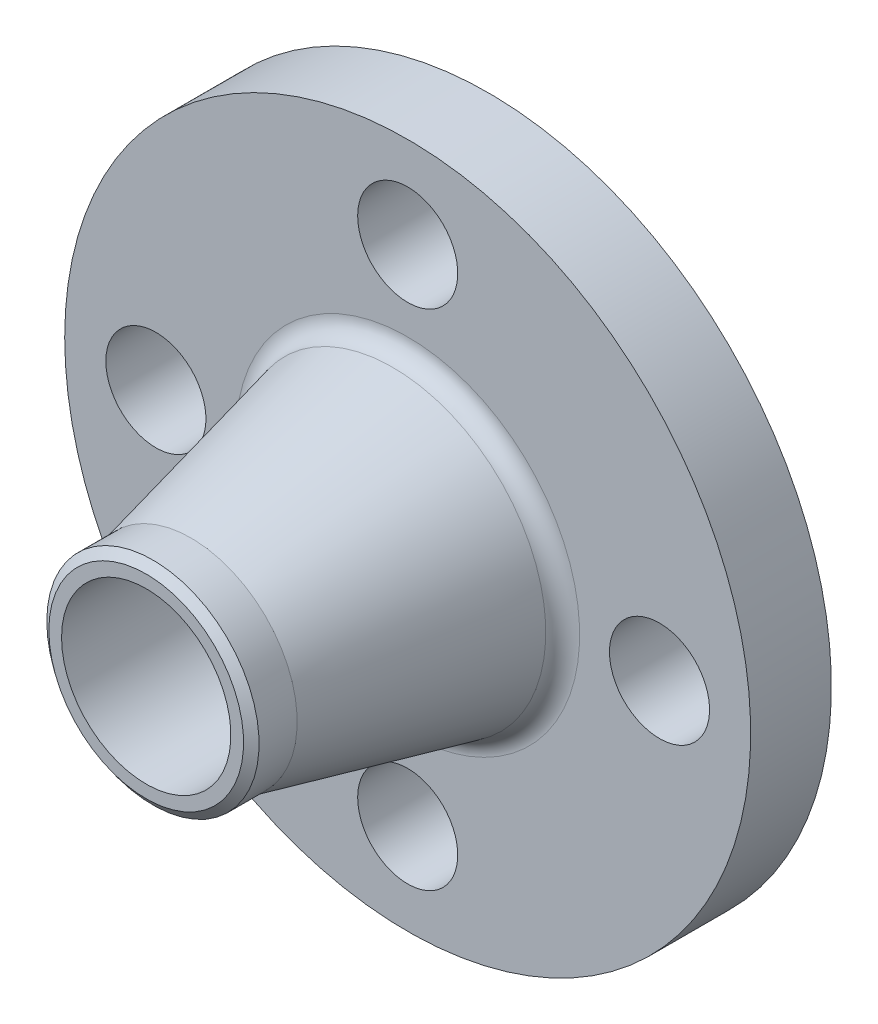
ISO-10303-21;
HEADER;
FILE_DESCRIPTION(('STEP AP214'),'2;1');
FILE_NAME('part.step','',(''),(''),'','','');
FILE_SCHEMA(('AUTOMOTIVE_DESIGN { 1 0 10303 214 1 1 1 1 }'));
ENDSEC;
DATA;
#1=APPLICATION_CONTEXT('core data for automotive mechanical design processes');
#2=APPLICATION_PROTOCOL_DEFINITION('international standard','automotive_design',2000,#1);
#3=PRODUCT_CONTEXT('',#1,'mechanical');
#4=PRODUCT('Part','Part','',(#3));
#5=PRODUCT_RELATED_PRODUCT_CATEGORY('part','',(#4));
#6=PRODUCT_DEFINITION_FORMATION('','',#4);
#7=PRODUCT_DEFINITION_CONTEXT('part definition',#1,'design');
#8=PRODUCT_DEFINITION('design','',#6,#7);
#9=PRODUCT_DEFINITION_SHAPE('','',#8);
#10=(LENGTH_UNIT() NAMED_UNIT(*) SI_UNIT(.MILLI.,.METRE.));
#11=(NAMED_UNIT(*) PLANE_ANGLE_UNIT() SI_UNIT($,.RADIAN.));
#12=(NAMED_UNIT(*) SI_UNIT($,.STERADIAN.) SOLID_ANGLE_UNIT());
#13=UNCERTAINTY_MEASURE_WITH_UNIT(LENGTH_MEASURE(1.E-05),#10,'distance_accuracy_value','');
#14=(GEOMETRIC_REPRESENTATION_CONTEXT(3) GLOBAL_UNCERTAINTY_ASSIGNED_CONTEXT((#13)) GLOBAL_UNIT_ASSIGNED_CONTEXT((#10,
#11,#12)) REPRESENTATION_CONTEXT('',''));
#15=CARTESIAN_POINT('',(0.,0.,0.));
#16=DIRECTION('',(0.,0.,1.));
#17=DIRECTION('',(1.,0.,0.));
#18=AXIS2_PLACEMENT_3D('',#15,#16,#17);
#19=CARTESIAN_POINT('',(39.624000000254,0.,12.6000000000512));
#20=DIRECTION('',(0.,0.,-1.));
#21=DIRECTION('',(0.877582561890188,-0.479425538604541,0.));
#22=AXIS2_PLACEMENT_3D('',#19,#20,#21);
#23=CYLINDRICAL_SURFACE('',#22,7.8740000000254);
#24=CARTESIAN_POINT('',(39.624000000254,0.,12.7000000000508));
#25=DIRECTION('',(0.,0.,-1.));
#26=DIRECTION('',(-1.,0.,0.));
#27=AXIS2_PLACEMENT_3D('',#24,#25,#26);
#28=CIRCLE('',#27,7.8740000000254);
#29=CARTESIAN_POINT('',(31.7500000002286,0.,12.7000000000508));
#30=VERTEX_POINT('',#29);
#31=EDGE_CURVE('E111',#30,#30,#28,.T.);
#32=ORIENTED_EDGE('',*,*,#31,.F.);
#33=EDGE_LOOP('',(#32));
#34=FACE_BOUND('',#33,.T.);
#35=CARTESIAN_POINT('',(39.624000000254,0.,0.));
#36=DIRECTION('',(0.,0.,-1.));
#37=DIRECTION('',(-1.,0.,0.));
#38=AXIS2_PLACEMENT_3D('',#35,#36,#37);
#39=CIRCLE('',#38,7.8740000000254);
#40=CARTESIAN_POINT('',(31.7500000002286,0.,0.));
#41=VERTEX_POINT('',#40);
#42=EDGE_CURVE('E148',#41,#41,#39,.T.);
#43=ORIENTED_EDGE('',*,*,#42,.T.);
#44=EDGE_LOOP('',(#43));
#45=FACE_BOUND('',#44,.T.);
#46=ADVANCED_FACE('F14',(#34,#45),#23,.F.);
#47=CARTESIAN_POINT('',(0.,0.,26.13025));
#48=DIRECTION('',(0.,0.,-1.));
#49=DIRECTION('',(0.479425538604541,0.877582561890188,0.));
#50=AXIS2_PLACEMENT_3D('',#47,#48,#49);
#51=CYLINDRICAL_SURFACE('',#50,53.975000000254);
#52=CARTESIAN_POINT('',(0.,0.,12.7000000000508));
#53=DIRECTION('',(0.,0.,-1.));
#54=DIRECTION('',(-1.,0.,0.));
#55=AXIS2_PLACEMENT_3D('',#52,#53,#54);
#56=CIRCLE('',#55,53.975000000254);
#57=CARTESIAN_POINT('',(-53.975000000254,0.,12.7000000000508));
#58=VERTEX_POINT('',#57);
#59=EDGE_CURVE('E105',#58,#58,#56,.T.);
#60=ORIENTED_EDGE('',*,*,#59,.T.);
#61=EDGE_LOOP('',(#60));
#62=FACE_BOUND('',#61,.T.);
#63=CARTESIAN_POINT('',(0.,0.,0.));
#64=DIRECTION('',(0.,0.,-1.));
#65=DIRECTION('',(-1.,0.,0.));
#66=AXIS2_PLACEMENT_3D('',#63,#64,#65);
#67=CIRCLE('',#66,53.975000000254);
#68=CARTESIAN_POINT('',(-53.975000000254,0.,0.));
#69=VERTEX_POINT('',#68);
#70=EDGE_CURVE('E161',#69,#69,#67,.T.);
#71=ORIENTED_EDGE('',*,*,#70,.F.);
#72=EDGE_LOOP('',(#71));
#73=FACE_BOUND('',#72,.T.);
#74=ADVANCED_FACE('F106',(#62,#73),#51,.T.);
#75=CARTESIAN_POINT('',(0.,0.,15.7480000000508));
#76=DIRECTION('',(0.,0.,-1.));
#77=DIRECTION('',(-0.479425538604541,-0.877582561890188,0.));
#78=AXIS2_PLACEMENT_3D('',#75,#76,#77);
#79=TOROIDAL_SURFACE('',#78,27.057844695226,3.048);
#80=CARTESIAN_POINT('',(0.,0.,12.7000000000508));
#81=DIRECTION('',(0.,0.,-1.));
#82=DIRECTION('',(-1.,0.,0.));
#83=AXIS2_PLACEMENT_3D('',#80,#81,#82);
#84=CIRCLE('',#83,27.057844695226);
#85=CARTESIAN_POINT('',(-27.057844695226,0.,12.7000000000508));
#86=VERTEX_POINT('',#85);
#87=EDGE_CURVE('E120',#86,#86,#84,.T.);
#88=ORIENTED_EDGE('',*,*,#87,.F.);
#89=EDGE_LOOP('',(#88));
#90=FACE_BOUND('',#89,.T.);
#91=CARTESIAN_POINT('',(0.,0.,15.0568034225788));
#92=DIRECTION('',(0.,0.,-1.));
#93=DIRECTION('',(-1.,0.,0.));
#94=AXIS2_PLACEMENT_3D('',#91,#92,#93);
#95=CIRCLE('',#94,24.0892505344582);
#96=CARTESIAN_POINT('',(-24.0892505344582,0.,15.0568034225788));
#97=VERTEX_POINT('',#96);
#98=EDGE_CURVE('E9',#97,#97,#95,.T.);
#99=ORIENTED_EDGE('',*,*,#98,.T.);
#100=EDGE_LOOP('',(#99));
#101=FACE_BOUND('',#100,.T.);
#102=ADVANCED_FACE('F203',(#90,#101),#79,.F.);
#103=CARTESIAN_POINT('',(0.,0.,46.790469945416));
#104=DIRECTION('',(0.,0.,-1.));
#105=DIRECTION('',(-0.479425538604541,-0.877582561890188,0.));
#106=AXIS2_PLACEMENT_3D('',#103,#104,#105);
#107=CONICAL_SURFACE('',#106,16.7005000000762,0.22876054256);
#108=CARTESIAN_POINT('',(0.,0.,46.790469945416));
#109=DIRECTION('',(0.,0.,-1.));
#110=DIRECTION('',(-1.,0.,0.));
#111=AXIS2_PLACEMENT_3D('',#108,#109,#110);
#112=CIRCLE('',#111,16.7005000000762);
#113=CARTESIAN_POINT('',(-16.7005000000762,0.,46.790469945416));
#114=VERTEX_POINT('',#113);
#115=EDGE_CURVE('E25',#114,#114,#112,.T.);
#116=ORIENTED_EDGE('',*,*,#115,.T.);
#117=EDGE_LOOP('',(#116));
#118=FACE_BOUND('',#117,.T.);
#119=ORIENTED_EDGE('',*,*,#98,.F.);
#120=EDGE_LOOP('',(#119));
#121=FACE_BOUND('',#120,.T.);
#122=ADVANCED_FACE('F221',(#118,#121),#107,.T.);
#123=CARTESIAN_POINT('',(0.,0.,26.13025));
#124=DIRECTION('',(0.,0.,-1.));
#125=DIRECTION('',(-0.479425538604541,-0.877582561890188,0.));
#126=AXIS2_PLACEMENT_3D('',#123,#124,#125);
#127=CYLINDRICAL_SURFACE('',#126,16.7005000000762);
#128=CARTESIAN_POINT('',(0.,0.,52.790469945392));
#129=DIRECTION('',(0.,0.,-1.));
#130=DIRECTION('',(-1.,0.,0.));
#131=AXIS2_PLACEMENT_3D('',#128,#129,#130);
#132=CIRCLE('',#131,16.7005000000762);
#133=CARTESIAN_POINT('',(-16.7005000000762,0.,52.790469945392));
#134=VERTEX_POINT('',#133);
#135=EDGE_CURVE('E129',#134,#134,#132,.T.);
#136=ORIENTED_EDGE('',*,*,#135,.T.);
#137=EDGE_LOOP('',(#136));
#138=FACE_BOUND('',#137,.T.);
#139=ORIENTED_EDGE('',*,*,#115,.F.);
#140=EDGE_LOOP('',(#139));
#141=FACE_BOUND('',#140,.T.);
#142=ADVANCED_FACE('F218',(#138,#141),#127,.T.);
#143=CARTESIAN_POINT('',(0.,0.,53.848000000254));
#144=DIRECTION('',(0.,0.,-1.));
#145=DIRECTION('',(-0.479425538604541,0.877582561890188,0.));
#146=AXIS2_PLACEMENT_3D('',#143,#144,#145);
#147=CONICAL_SURFACE('',#146,15.3223000000428,0.916297857297);
#148=CARTESIAN_POINT('',(0.,0.,53.848000000254));
#149=DIRECTION('',(0.,0.,-1.));
#150=DIRECTION('',(-1.,0.,0.));
#151=AXIS2_PLACEMENT_3D('',#148,#149,#150);
#152=CIRCLE('',#151,15.3223000000428);
#153=CARTESIAN_POINT('',(-15.3223000000428,0.,53.848000000254));
#154=VERTEX_POINT('',#153);
#155=EDGE_CURVE('E130',#154,#154,#152,.T.);
#156=ORIENTED_EDGE('',*,*,#155,.T.);
#157=EDGE_LOOP('',(#156));
#158=FACE_BOUND('',#157,.T.);
#159=ORIENTED_EDGE('',*,*,#135,.F.);
#160=EDGE_LOOP('',(#159));
#161=FACE_BOUND('',#160,.T.);
#162=ADVANCED_FACE('F216',(#158,#161),#147,.T.);
#163=CARTESIAN_POINT('',(0.,0.,26.13025));
#164=DIRECTION('',(0.,0.,-1.));
#165=DIRECTION('',(-0.479425538604541,-0.877582561890188,0.));
#166=AXIS2_PLACEMENT_3D('',#163,#164,#165);
#167=CYLINDRICAL_SURFACE('',#166,13.3223000000508);
#168=CARTESIAN_POINT('',(0.,0.,53.848000000254));
#169=DIRECTION('',(0.,0.,-1.));
#170=DIRECTION('',(-1.,0.,0.));
#171=AXIS2_PLACEMENT_3D('',#168,#169,#170);
#172=CIRCLE('',#171,13.3223000000508);
#173=CARTESIAN_POINT('',(-13.3223000000508,0.,53.848000000254));
#174=VERTEX_POINT('',#173);
#175=EDGE_CURVE('E124',#174,#174,#172,.T.);
#176=ORIENTED_EDGE('',*,*,#175,.F.);
#177=EDGE_LOOP('',(#176));
#178=FACE_BOUND('',#177,.T.);
#179=CARTESIAN_POINT('',(0.,0.,-1.58750000000762));
#180=DIRECTION('',(0.,0.,-1.));
#181=DIRECTION('',(-1.,0.,0.));
#182=AXIS2_PLACEMENT_3D('',#179,#180,#181);
#183=CIRCLE('',#182,13.3223000000508);
#184=CARTESIAN_POINT('',(-13.3223000000508,0.,-1.58750000000762));
#185=VERTEX_POINT('',#184);
#186=EDGE_CURVE('E126',#185,#185,#183,.T.);
#187=ORIENTED_EDGE('',*,*,#186,.T.);
#188=EDGE_LOOP('',(#187));
#189=FACE_BOUND('',#188,.T.);
#190=ADVANCED_FACE('F212',(#178,#189),#167,.F.);
#191=CARTESIAN_POINT('',(0.,13.3223000000508,-1.58750000000762));
#192=DIRECTION('',(0.,0.,-1.));
#193=DIRECTION('',(0.,-1.,0.));
#194=AXIS2_PLACEMENT_3D('',#191,#192,#193);
#195=PLANE('',#194);
#196=CARTESIAN_POINT('',(0.,0.,-1.58750000000762));
#197=DIRECTION('',(0.,0.,-1.));
#198=DIRECTION('',(-1.,0.,0.));
#199=AXIS2_PLACEMENT_3D('',#196,#197,#198);
#200=CIRCLE('',#199,25.4);
#201=CARTESIAN_POINT('',(-25.4,0.,-1.58750000000762));
#202=VERTEX_POINT('',#201);
#203=EDGE_CURVE('E155',#202,#202,#200,.T.);
#204=ORIENTED_EDGE('',*,*,#203,.T.);
#205=EDGE_LOOP('',(#204));
#206=FACE_BOUND('',#205,.T.);
#207=ORIENTED_EDGE('',*,*,#186,.F.);
#208=EDGE_LOOP('',(#207));
#209=FACE_BOUND('',#208,.T.);
#210=ADVANCED_FACE('F215',(#206,#209),#195,.T.);
#211=CARTESIAN_POINT('',(0.,16.7005000000762,53.848000000254));
#212=DIRECTION('',(0.,0.,-1.));
#213=DIRECTION('',(0.,-1.,0.));
#214=AXIS2_PLACEMENT_3D('',#211,#212,#213);
#215=PLANE('',#214);
#216=ORIENTED_EDGE('',*,*,#155,.F.);
#217=EDGE_LOOP('',(#216));
#218=FACE_BOUND('',#217,.T.);
#219=ORIENTED_EDGE('',*,*,#175,.T.);
#220=EDGE_LOOP('',(#219));
#221=FACE_BOUND('',#220,.T.);
#222=ADVANCED_FACE('F210',(#218,#221),#215,.F.);
#223=CARTESIAN_POINT('',(0.,0.,26.13025));
#224=DIRECTION('',(0.,0.,-1.));
#225=DIRECTION('',(0.479425538604541,0.877582561890188,0.));
#226=AXIS2_PLACEMENT_3D('',#223,#224,#225);
#227=CYLINDRICAL_SURFACE('',#226,25.4);
#228=CARTESIAN_POINT('',(0.,0.,0.));
#229=DIRECTION('',(0.,0.,-1.));
#230=DIRECTION('',(-1.,0.,0.));
#231=AXIS2_PLACEMENT_3D('',#228,#229,#230);
#232=CIRCLE('',#231,25.4);
#233=CARTESIAN_POINT('',(-25.4,0.,0.));
#234=VERTEX_POINT('',#233);
#235=EDGE_CURVE('E138',#234,#234,#232,.T.);
#236=ORIENTED_EDGE('',*,*,#235,.T.);
#237=EDGE_LOOP('',(#236));
#238=FACE_BOUND('',#237,.T.);
#239=ORIENTED_EDGE('',*,*,#203,.F.);
#240=EDGE_LOOP('',(#239));
#241=FACE_BOUND('',#240,.T.);
#242=ADVANCED_FACE('F182',(#238,#241),#227,.T.);
#243=CARTESIAN_POINT('',(0.,25.4,0.));
#244=DIRECTION('',(0.,0.,-1.));
#245=DIRECTION('',(0.,-1.,0.));
#246=AXIS2_PLACEMENT_3D('',#243,#244,#245);
#247=PLANE('',#246);
#248=ORIENTED_EDGE('',*,*,#70,.T.);
#249=EDGE_LOOP('',(#248));
#250=FACE_BOUND('',#249,.T.);
#251=ORIENTED_EDGE('',*,*,#42,.F.);
#252=EDGE_LOOP('',(#251));
#253=FACE_BOUND('',#252,.T.);
#254=ORIENTED_EDGE('',*,*,#235,.F.);
#255=EDGE_LOOP('',(#254));
#256=FACE_BOUND('',#255,.T.);
#257=CARTESIAN_POINT('',(0.,-39.624000000254,0.));
#258=DIRECTION('',(0.,0.,-1.));
#259=DIRECTION('',(-1.,0.,0.));
#260=AXIS2_PLACEMENT_3D('',#257,#258,#259);
#261=CIRCLE('',#260,7.8740000000254);
#262=CARTESIAN_POINT('',(-7.8740000000254,-39.624000000254,0.));
#263=VERTEX_POINT('',#262);
#264=EDGE_CURVE('E110',#263,#263,#261,.T.);
#265=ORIENTED_EDGE('',*,*,#264,.F.);
#266=EDGE_LOOP('',(#265));
#267=FACE_BOUND('',#266,.T.);
#268=CARTESIAN_POINT('',(-39.624000000254,0.,0.));
#269=DIRECTION('',(0.,0.,-1.));
#270=DIRECTION('',(-1.,0.,0.));
#271=AXIS2_PLACEMENT_3D('',#268,#269,#270);
#272=CIRCLE('',#271,7.8740000000254);
#273=CARTESIAN_POINT('',(-47.4980000002794,0.,0.));
#274=VERTEX_POINT('',#273);
#275=EDGE_CURVE('E118',#274,#274,#272,.T.);
#276=ORIENTED_EDGE('',*,*,#275,.F.);
#277=EDGE_LOOP('',(#276));
#278=FACE_BOUND('',#277,.T.);
#279=CARTESIAN_POINT('',(0.,39.624000000254,0.));
#280=DIRECTION('',(0.,0.,-1.));
#281=DIRECTION('',(-1.,0.,0.));
#282=AXIS2_PLACEMENT_3D('',#279,#280,#281);
#283=CIRCLE('',#282,7.8740000000254);
#284=CARTESIAN_POINT('',(-7.87400000002541,39.624000000254,0.));
#285=VERTEX_POINT('',#284);
#286=EDGE_CURVE('E135',#285,#285,#283,.T.);
#287=ORIENTED_EDGE('',*,*,#286,.F.);
#288=EDGE_LOOP('',(#287));
#289=FACE_BOUND('',#288,.T.);
#290=ADVANCED_FACE('F179',(#250,#253,#256,#267,#278,#289),#247,.T.);
#291=CARTESIAN_POINT('',(0.,39.624000000254,12.6000000000512));
#292=DIRECTION('',(0.,0.,-1.));
#293=DIRECTION('',(0.479425538604541,0.877582561890188,0.));
#294=AXIS2_PLACEMENT_3D('',#291,#292,#293);
#295=CYLINDRICAL_SURFACE('',#294,7.8740000000254);
#296=CARTESIAN_POINT('',(0.,39.624000000254,12.7000000000508));
#297=DIRECTION('',(0.,0.,-1.));
#298=DIRECTION('',(-1.,0.,0.));
#299=AXIS2_PLACEMENT_3D('',#296,#297,#298);
#300=CIRCLE('',#299,7.8740000000254);
#301=CARTESIAN_POINT('',(-7.87400000002541,39.624000000254,12.7000000000508));
#302=VERTEX_POINT('',#301);
#303=EDGE_CURVE('E139',#302,#302,#300,.T.);
#304=ORIENTED_EDGE('',*,*,#303,.F.);
#305=EDGE_LOOP('',(#304));
#306=FACE_BOUND('',#305,.T.);
#307=ORIENTED_EDGE('',*,*,#286,.T.);
#308=EDGE_LOOP('',(#307));
#309=FACE_BOUND('',#308,.T.);
#310=ADVANCED_FACE('F16',(#306,#309),#295,.F.);
#311=CARTESIAN_POINT('',(-39.624000000254,0.,12.6000000000512));
#312=DIRECTION('',(0.,0.,-1.));
#313=DIRECTION('',(-0.877582561890188,0.479425538604541,0.));
#314=AXIS2_PLACEMENT_3D('',#311,#312,#313);
#315=CYLINDRICAL_SURFACE('',#314,7.8740000000254);
#316=CARTESIAN_POINT('',(-39.624000000254,0.,12.7000000000508));
#317=DIRECTION('',(0.,0.,-1.));
#318=DIRECTION('',(-1.,0.,0.));
#319=AXIS2_PLACEMENT_3D('',#316,#317,#318);
#320=CIRCLE('',#319,7.8740000000254);
#321=CARTESIAN_POINT('',(-47.4980000002794,0.,12.7000000000508));
#322=VERTEX_POINT('',#321);
#323=EDGE_CURVE('E141',#322,#322,#320,.T.);
#324=ORIENTED_EDGE('',*,*,#323,.F.);
#325=EDGE_LOOP('',(#324));
#326=FACE_BOUND('',#325,.T.);
#327=ORIENTED_EDGE('',*,*,#275,.T.);
#328=EDGE_LOOP('',(#327));
#329=FACE_BOUND('',#328,.T.);
#330=ADVANCED_FACE('F177',(#326,#329),#315,.F.);
#331=CARTESIAN_POINT('',(0.,-39.624000000254,12.6000000000512));
#332=DIRECTION('',(0.,0.,-1.));
#333=DIRECTION('',(-0.479425538604541,-0.877582561890188,0.));
#334=AXIS2_PLACEMENT_3D('',#331,#332,#333);
#335=CYLINDRICAL_SURFACE('',#334,7.8740000000254);
#336=CARTESIAN_POINT('',(0.,-39.624000000254,12.7000000000508));
#337=DIRECTION('',(0.,0.,-1.));
#338=DIRECTION('',(-1.,0.,0.));
#339=AXIS2_PLACEMENT_3D('',#336,#337,#338);
#340=CIRCLE('',#339,7.8740000000254);
#341=CARTESIAN_POINT('',(-7.8740000000254,-39.624000000254,12.7000000000508));
#342=VERTEX_POINT('',#341);
#343=EDGE_CURVE('E18',#342,#342,#340,.T.);
#344=ORIENTED_EDGE('',*,*,#343,.F.);
#345=EDGE_LOOP('',(#344));
#346=FACE_BOUND('',#345,.T.);
#347=ORIENTED_EDGE('',*,*,#264,.T.);
#348=EDGE_LOOP('',(#347));
#349=FACE_BOUND('',#348,.T.);
#350=ADVANCED_FACE('F193',(#346,#349),#335,.F.);
#351=CARTESIAN_POINT('',(0.,53.975000000254,12.7000000000508));
#352=DIRECTION('',(0.,0.,-1.));
#353=DIRECTION('',(0.,-1.,0.));
#354=AXIS2_PLACEMENT_3D('',#351,#352,#353);
#355=PLANE('',#354);
#356=ORIENTED_EDGE('',*,*,#59,.F.);
#357=EDGE_LOOP('',(#356));
#358=FACE_BOUND('',#357,.T.);
#359=ORIENTED_EDGE('',*,*,#31,.T.);
#360=EDGE_LOOP('',(#359));
#361=FACE_BOUND('',#360,.T.);
#362=ORIENTED_EDGE('',*,*,#87,.T.);
#363=EDGE_LOOP('',(#362));
#364=FACE_BOUND('',#363,.T.);
#365=ORIENTED_EDGE('',*,*,#343,.T.);
#366=EDGE_LOOP('',(#365));
#367=FACE_BOUND('',#366,.T.);
#368=ORIENTED_EDGE('',*,*,#323,.T.);
#369=EDGE_LOOP('',(#368));
#370=FACE_BOUND('',#369,.T.);
#371=ORIENTED_EDGE('',*,*,#303,.T.);
#372=EDGE_LOOP('',(#371));
#373=FACE_BOUND('',#372,.T.);
#374=ADVANCED_FACE('F223',(#358,#361,#364,#367,#370,#373),#355,.F.);
#375=CLOSED_SHELL('',(#46,#74,#102,#122,#142,#162,#190,#210,#222,#242,#290,#310,#330,#350,#374));
#376=MANIFOLD_SOLID_BREP('B1',#375);
#377=ADVANCED_BREP_SHAPE_REPRESENTATION('',(#18,#376),#14);
#378=SHAPE_DEFINITION_REPRESENTATION(#9,#377);
ENDSEC;
END-ISO-10303-21;
